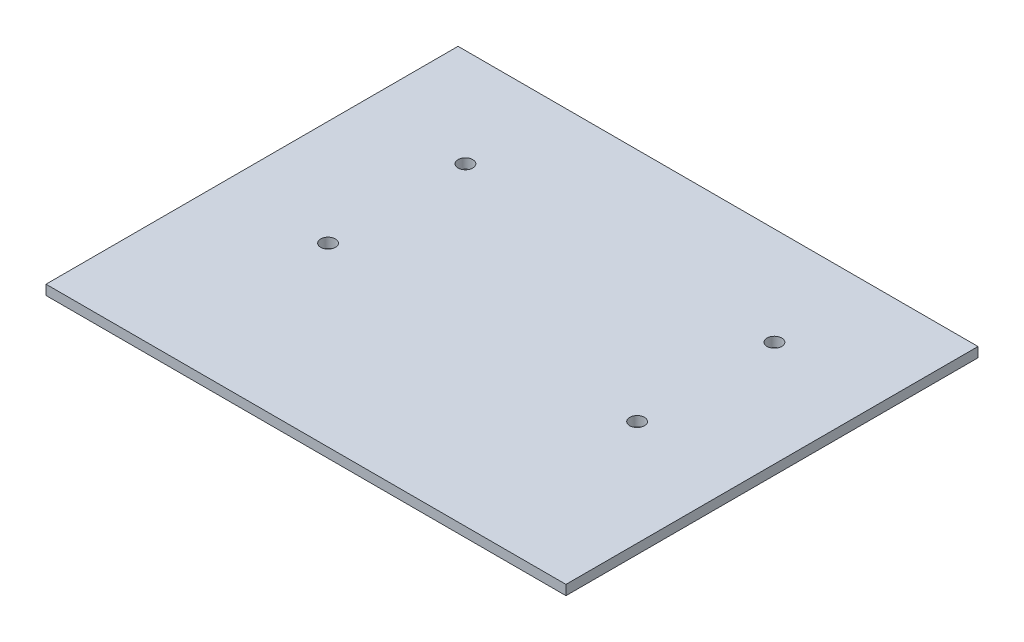
ISO-10303-21;
HEADER;
FILE_DESCRIPTION(('STEP AP214'),'2;1');
FILE_NAME('part.step','',(''),(''),'','','');
FILE_SCHEMA(('AUTOMOTIVE_DESIGN { 1 0 10303 214 1 1 1 1 }'));
ENDSEC;
DATA;
#1=APPLICATION_CONTEXT('core data for automotive mechanical design processes');
#2=APPLICATION_PROTOCOL_DEFINITION('international standard','automotive_design',2000,#1);
#3=PRODUCT_CONTEXT('',#1,'mechanical');
#4=PRODUCT('Part','Part','',(#3));
#5=PRODUCT_RELATED_PRODUCT_CATEGORY('part','',(#4));
#6=PRODUCT_DEFINITION_FORMATION('','',#4);
#7=PRODUCT_DEFINITION_CONTEXT('part definition',#1,'design');
#8=PRODUCT_DEFINITION('design','',#6,#7);
#9=PRODUCT_DEFINITION_SHAPE('','',#8);
#10=(LENGTH_UNIT() NAMED_UNIT(*) SI_UNIT(.MILLI.,.METRE.));
#11=(NAMED_UNIT(*) PLANE_ANGLE_UNIT() SI_UNIT($,.RADIAN.));
#12=(NAMED_UNIT(*) SI_UNIT($,.STERADIAN.) SOLID_ANGLE_UNIT());
#13=UNCERTAINTY_MEASURE_WITH_UNIT(LENGTH_MEASURE(1.E-05),#10,'distance_accuracy_value','');
#14=(GEOMETRIC_REPRESENTATION_CONTEXT(3) GLOBAL_UNCERTAINTY_ASSIGNED_CONTEXT((#13)) GLOBAL_UNIT_ASSIGNED_CONTEXT((#10,
#11,#12)) REPRESENTATION_CONTEXT('',''));
#15=CARTESIAN_POINT('',(0.,0.,0.));
#16=DIRECTION('',(0.,0.,1.));
#17=DIRECTION('',(1.,0.,0.));
#18=AXIS2_PLACEMENT_3D('',#15,#16,#17);
#19=CARTESIAN_POINT('',(0.,2.,0.));
#20=DIRECTION('',(0.,-1.,0.));
#21=DIRECTION('',(0.,0.,-1.));
#22=AXIS2_PLACEMENT_3D('',#19,#20,#21);
#23=PLANE('',#22);
#24=DIRECTION('',(0.,0.,1.));
#25=VECTOR('',#24,1.);
#26=CARTESIAN_POINT('',(0.,2.,0.));
#27=LINE('',#26,#25);
#28=CARTESIAN_POINT('',(0.,2.,-84.));
#29=VERTEX_POINT('',#28);
#30=CARTESIAN_POINT('',(0.,2.,0.));
#31=VERTEX_POINT('',#30);
#32=EDGE_CURVE('E91',#29,#31,#27,.T.);
#33=ORIENTED_EDGE('',*,*,#32,.T.);
#34=DIRECTION('',(1.,0.,0.));
#35=VECTOR('',#34,1.);
#36=CARTESIAN_POINT('',(0.,2.,0.));
#37=LINE('',#36,#35);
#38=CARTESIAN_POINT('',(106.,2.,0.));
#39=VERTEX_POINT('',#38);
#40=EDGE_CURVE('E86',#31,#39,#37,.T.);
#41=ORIENTED_EDGE('',*,*,#40,.T.);
#42=DIRECTION('',(0.,0.,-1.));
#43=VECTOR('',#42,1.);
#44=CARTESIAN_POINT('',(106.,2.,0.));
#45=LINE('',#44,#43);
#46=CARTESIAN_POINT('',(106.,2.,-84.));
#47=VERTEX_POINT('',#46);
#48=EDGE_CURVE('E89',#39,#47,#45,.T.);
#49=ORIENTED_EDGE('',*,*,#48,.T.);
#50=DIRECTION('',(-1.,0.,0.));
#51=VECTOR('',#50,1.);
#52=CARTESIAN_POINT('',(0.,2.,-84.));
#53=LINE('',#52,#51);
#54=EDGE_CURVE('E56',#47,#29,#53,.T.);
#55=ORIENTED_EDGE('',*,*,#54,.T.);
#56=EDGE_LOOP('',(#33,#41,#49,#55));
#57=FACE_BOUND('',#56,.T.);
#58=CARTESIAN_POINT('',(84.5,2.,-64.));
#59=DIRECTION('',(0.,1.,0.));
#60=DIRECTION('',(0.,0.,1.));
#61=AXIS2_PLACEMENT_3D('',#58,#59,#60);
#62=CIRCLE('',#61,1.5);
#63=CARTESIAN_POINT('',(84.5,2.,-62.5));
#64=VERTEX_POINT('',#63);
#65=EDGE_CURVE('E106',#64,#64,#62,.T.);
#66=ORIENTED_EDGE('',*,*,#65,.F.);
#67=EDGE_LOOP('',(#66));
#68=FACE_BOUND('',#67,.T.);
#69=CARTESIAN_POINT('',(84.5,2.,-36.));
#70=DIRECTION('',(0.,1.,0.));
#71=DIRECTION('',(0.,0.,1.));
#72=AXIS2_PLACEMENT_3D('',#69,#70,#71);
#73=CIRCLE('',#72,1.5);
#74=CARTESIAN_POINT('',(84.5,2.,-34.5));
#75=VERTEX_POINT('',#74);
#76=EDGE_CURVE('E121',#75,#75,#73,.T.);
#77=ORIENTED_EDGE('',*,*,#76,.F.);
#78=EDGE_LOOP('',(#77));
#79=FACE_BOUND('',#78,.T.);
#80=CARTESIAN_POINT('',(21.5,2.,-36.));
#81=DIRECTION('',(0.,1.,0.));
#82=DIRECTION('',(0.,0.,1.));
#83=AXIS2_PLACEMENT_3D('',#80,#81,#82);
#84=CIRCLE('',#83,1.5);
#85=CARTESIAN_POINT('',(21.5,2.,-34.5));
#86=VERTEX_POINT('',#85);
#87=EDGE_CURVE('E127',#86,#86,#84,.T.);
#88=ORIENTED_EDGE('',*,*,#87,.F.);
#89=EDGE_LOOP('',(#88));
#90=FACE_BOUND('',#89,.T.);
#91=CARTESIAN_POINT('',(21.5,2.,-64.));
#92=DIRECTION('',(0.,1.,0.));
#93=DIRECTION('',(0.,0.,1.));
#94=AXIS2_PLACEMENT_3D('',#91,#92,#93);
#95=CIRCLE('',#94,1.5);
#96=CARTESIAN_POINT('',(21.5,2.,-62.5));
#97=VERTEX_POINT('',#96);
#98=EDGE_CURVE('E133',#97,#97,#95,.T.);
#99=ORIENTED_EDGE('',*,*,#98,.F.);
#100=EDGE_LOOP('',(#99));
#101=FACE_BOUND('',#100,.T.);
#102=ADVANCED_FACE('F39',(#57,#68,#79,#90,#101),#23,.F.);
#103=CARTESIAN_POINT('',(0.,0.,0.));
#104=DIRECTION('',(0.,-1.,0.));
#105=DIRECTION('',(0.,0.,-1.));
#106=AXIS2_PLACEMENT_3D('',#103,#104,#105);
#107=PLANE('',#106);
#108=CARTESIAN_POINT('',(21.5,0.,-36.));
#109=DIRECTION('',(0.,1.,0.));
#110=DIRECTION('',(0.,0.,1.));
#111=AXIS2_PLACEMENT_3D('',#108,#109,#110);
#112=CIRCLE('',#111,1.5);
#113=CARTESIAN_POINT('',(21.5,0.,-34.5));
#114=VERTEX_POINT('',#113);
#115=EDGE_CURVE('E130',#114,#114,#112,.T.);
#116=ORIENTED_EDGE('',*,*,#115,.T.);
#117=EDGE_LOOP('',(#116));
#118=FACE_BOUND('',#117,.T.);
#119=CARTESIAN_POINT('',(84.5,0.,-64.));
#120=DIRECTION('',(0.,1.,0.));
#121=DIRECTION('',(0.,0.,1.));
#122=AXIS2_PLACEMENT_3D('',#119,#120,#121);
#123=CIRCLE('',#122,1.5);
#124=CARTESIAN_POINT('',(84.5,0.,-62.5));
#125=VERTEX_POINT('',#124);
#126=EDGE_CURVE('E118',#125,#125,#123,.T.);
#127=ORIENTED_EDGE('',*,*,#126,.T.);
#128=EDGE_LOOP('',(#127));
#129=FACE_BOUND('',#128,.T.);
#130=DIRECTION('',(0.,0.,1.));
#131=VECTOR('',#130,1.);
#132=CARTESIAN_POINT('',(0.,0.,0.));
#133=LINE('',#132,#131);
#134=CARTESIAN_POINT('',(0.,0.,-84.));
#135=VERTEX_POINT('',#134);
#136=CARTESIAN_POINT('',(0.,0.,0.));
#137=VERTEX_POINT('',#136);
#138=EDGE_CURVE('E103',#135,#137,#133,.T.);
#139=ORIENTED_EDGE('',*,*,#138,.F.);
#140=DIRECTION('',(-1.,0.,0.));
#141=VECTOR('',#140,1.);
#142=CARTESIAN_POINT('',(0.,0.,-84.));
#143=LINE('',#142,#141);
#144=CARTESIAN_POINT('',(106.,0.,-84.));
#145=VERTEX_POINT('',#144);
#146=EDGE_CURVE('E79',#145,#135,#143,.T.);
#147=ORIENTED_EDGE('',*,*,#146,.F.);
#148=DIRECTION('',(0.,0.,-1.));
#149=VECTOR('',#148,1.);
#150=CARTESIAN_POINT('',(106.,0.,0.));
#151=LINE('',#150,#149);
#152=CARTESIAN_POINT('',(106.,0.,0.));
#153=VERTEX_POINT('',#152);
#154=EDGE_CURVE('E73',#153,#145,#151,.T.);
#155=ORIENTED_EDGE('',*,*,#154,.F.);
#156=DIRECTION('',(1.,0.,0.));
#157=VECTOR('',#156,1.);
#158=CARTESIAN_POINT('',(0.,0.,0.));
#159=LINE('',#158,#157);
#160=EDGE_CURVE('E95',#137,#153,#159,.T.);
#161=ORIENTED_EDGE('',*,*,#160,.F.);
#162=EDGE_LOOP('',(#139,#147,#155,#161));
#163=FACE_BOUND('',#162,.T.);
#164=CARTESIAN_POINT('',(84.5,0.,-36.));
#165=DIRECTION('',(0.,1.,0.));
#166=DIRECTION('',(0.,0.,1.));
#167=AXIS2_PLACEMENT_3D('',#164,#165,#166);
#168=CIRCLE('',#167,1.5);
#169=CARTESIAN_POINT('',(84.5,0.,-34.5));
#170=VERTEX_POINT('',#169);
#171=EDGE_CURVE('E124',#170,#170,#168,.T.);
#172=ORIENTED_EDGE('',*,*,#171,.T.);
#173=EDGE_LOOP('',(#172));
#174=FACE_BOUND('',#173,.T.);
#175=CARTESIAN_POINT('',(21.5,0.,-64.));
#176=DIRECTION('',(0.,1.,0.));
#177=DIRECTION('',(0.,0.,1.));
#178=AXIS2_PLACEMENT_3D('',#175,#176,#177);
#179=CIRCLE('',#178,1.5);
#180=CARTESIAN_POINT('',(21.5,0.,-62.5));
#181=VERTEX_POINT('',#180);
#182=EDGE_CURVE('E136',#181,#181,#179,.T.);
#183=ORIENTED_EDGE('',*,*,#182,.T.);
#184=EDGE_LOOP('',(#183));
#185=FACE_BOUND('',#184,.T.);
#186=ADVANCED_FACE('F114',(#118,#129,#163,#174,#185),#107,.T.);
#187=CARTESIAN_POINT('',(0.,2.,0.));
#188=DIRECTION('',(1.,0.,0.));
#189=DIRECTION('',(0.,0.,-1.));
#190=AXIS2_PLACEMENT_3D('',#187,#188,#189);
#191=PLANE('',#190);
#192=ORIENTED_EDGE('',*,*,#138,.T.);
#193=DIRECTION('',(0.,-1.,0.));
#194=VECTOR('',#193,1.);
#195=CARTESIAN_POINT('',(0.,2.,0.));
#196=LINE('',#195,#194);
#197=EDGE_CURVE('E11',#31,#137,#196,.T.);
#198=ORIENTED_EDGE('',*,*,#197,.F.);
#199=ORIENTED_EDGE('',*,*,#32,.F.);
#200=DIRECTION('',(0.,-1.,0.));
#201=VECTOR('',#200,1.);
#202=CARTESIAN_POINT('',(0.,2.,-84.));
#203=LINE('',#202,#201);
#204=EDGE_CURVE('E99',#29,#135,#203,.T.);
#205=ORIENTED_EDGE('',*,*,#204,.T.);
#206=EDGE_LOOP('',(#192,#198,#199,#205));
#207=FACE_BOUND('',#206,.T.);
#208=ADVANCED_FACE('F41',(#207),#191,.F.);
#209=CARTESIAN_POINT('',(0.,2.,0.));
#210=DIRECTION('',(0.,0.,-1.));
#211=DIRECTION('',(-1.,0.,0.));
#212=AXIS2_PLACEMENT_3D('',#209,#210,#211);
#213=PLANE('',#212);
#214=ORIENTED_EDGE('',*,*,#160,.T.);
#215=DIRECTION('',(0.,-1.,0.));
#216=VECTOR('',#215,1.);
#217=CARTESIAN_POINT('',(106.,2.,0.));
#218=LINE('',#217,#216);
#219=EDGE_CURVE('E48',#39,#153,#218,.T.);
#220=ORIENTED_EDGE('',*,*,#219,.F.);
#221=ORIENTED_EDGE('',*,*,#40,.F.);
#222=ORIENTED_EDGE('',*,*,#197,.T.);
#223=EDGE_LOOP('',(#214,#220,#221,#222));
#224=FACE_BOUND('',#223,.T.);
#225=ADVANCED_FACE('F94',(#224),#213,.F.);
#226=CARTESIAN_POINT('',(106.,2.,0.));
#227=DIRECTION('',(-1.,0.,0.));
#228=DIRECTION('',(0.,0.,1.));
#229=AXIS2_PLACEMENT_3D('',#226,#227,#228);
#230=PLANE('',#229);
#231=ORIENTED_EDGE('',*,*,#154,.T.);
#232=DIRECTION('',(0.,-1.,0.));
#233=VECTOR('',#232,1.);
#234=CARTESIAN_POINT('',(106.,2.,-84.));
#235=LINE('',#234,#233);
#236=EDGE_CURVE('E96',#47,#145,#235,.T.);
#237=ORIENTED_EDGE('',*,*,#236,.F.);
#238=ORIENTED_EDGE('',*,*,#48,.F.);
#239=ORIENTED_EDGE('',*,*,#219,.T.);
#240=EDGE_LOOP('',(#231,#237,#238,#239));
#241=FACE_BOUND('',#240,.T.);
#242=ADVANCED_FACE('F97',(#241),#230,.F.);
#243=CARTESIAN_POINT('',(0.,2.,-84.));
#244=DIRECTION('',(0.,0.,1.));
#245=DIRECTION('',(1.,0.,0.));
#246=AXIS2_PLACEMENT_3D('',#243,#244,#245);
#247=PLANE('',#246);
#248=ORIENTED_EDGE('',*,*,#146,.T.);
#249=ORIENTED_EDGE('',*,*,#204,.F.);
#250=ORIENTED_EDGE('',*,*,#54,.F.);
#251=ORIENTED_EDGE('',*,*,#236,.T.);
#252=EDGE_LOOP('',(#248,#249,#250,#251));
#253=FACE_BOUND('',#252,.T.);
#254=ADVANCED_FACE('F111',(#253),#247,.F.);
#255=CARTESIAN_POINT('',(84.5,2.,-64.));
#256=DIRECTION('',(0.,-1.,0.));
#257=DIRECTION('',(0.,0.,-1.));
#258=AXIS2_PLACEMENT_3D('',#255,#256,#257);
#259=CYLINDRICAL_SURFACE('',#258,1.5);
#260=ORIENTED_EDGE('',*,*,#65,.T.);
#261=EDGE_LOOP('',(#260));
#262=FACE_BOUND('',#261,.T.);
#263=ORIENTED_EDGE('',*,*,#126,.F.);
#264=EDGE_LOOP('',(#263));
#265=FACE_BOUND('',#264,.T.);
#266=ADVANCED_FACE('F153',(#262,#265),#259,.F.);
#267=CARTESIAN_POINT('',(84.5,2.,-36.));
#268=DIRECTION('',(0.,-1.,0.));
#269=DIRECTION('',(0.,0.,-1.));
#270=AXIS2_PLACEMENT_3D('',#267,#268,#269);
#271=CYLINDRICAL_SURFACE('',#270,1.5);
#272=ORIENTED_EDGE('',*,*,#76,.T.);
#273=EDGE_LOOP('',(#272));
#274=FACE_BOUND('',#273,.T.);
#275=ORIENTED_EDGE('',*,*,#171,.F.);
#276=EDGE_LOOP('',(#275));
#277=FACE_BOUND('',#276,.T.);
#278=ADVANCED_FACE('F198',(#274,#277),#271,.F.);
#279=CARTESIAN_POINT('',(21.5,2.,-36.));
#280=DIRECTION('',(0.,-1.,0.));
#281=DIRECTION('',(0.,0.,-1.));
#282=AXIS2_PLACEMENT_3D('',#279,#280,#281);
#283=CYLINDRICAL_SURFACE('',#282,1.5);
#284=ORIENTED_EDGE('',*,*,#87,.T.);
#285=EDGE_LOOP('',(#284));
#286=FACE_BOUND('',#285,.T.);
#287=ORIENTED_EDGE('',*,*,#115,.F.);
#288=EDGE_LOOP('',(#287));
#289=FACE_BOUND('',#288,.T.);
#290=ADVANCED_FACE('F206',(#286,#289),#283,.F.);
#291=CARTESIAN_POINT('',(21.5,2.,-64.));
#292=DIRECTION('',(0.,-1.,0.));
#293=DIRECTION('',(0.,0.,-1.));
#294=AXIS2_PLACEMENT_3D('',#291,#292,#293);
#295=CYLINDRICAL_SURFACE('',#294,1.5);
#296=ORIENTED_EDGE('',*,*,#98,.T.);
#297=EDGE_LOOP('',(#296));
#298=FACE_BOUND('',#297,.T.);
#299=ORIENTED_EDGE('',*,*,#182,.F.);
#300=EDGE_LOOP('',(#299));
#301=FACE_BOUND('',#300,.T.);
#302=ADVANCED_FACE('F142',(#298,#301),#295,.F.);
#303=CLOSED_SHELL('',(#102,#186,#208,#225,#242,#254,#266,#278,#290,#302));
#304=MANIFOLD_SOLID_BREP('B2',#303);
#305=ADVANCED_BREP_SHAPE_REPRESENTATION('',(#18,#304),#14);
#306=SHAPE_DEFINITION_REPRESENTATION(#9,#305);
ENDSEC;
END-ISO-10303-21;
